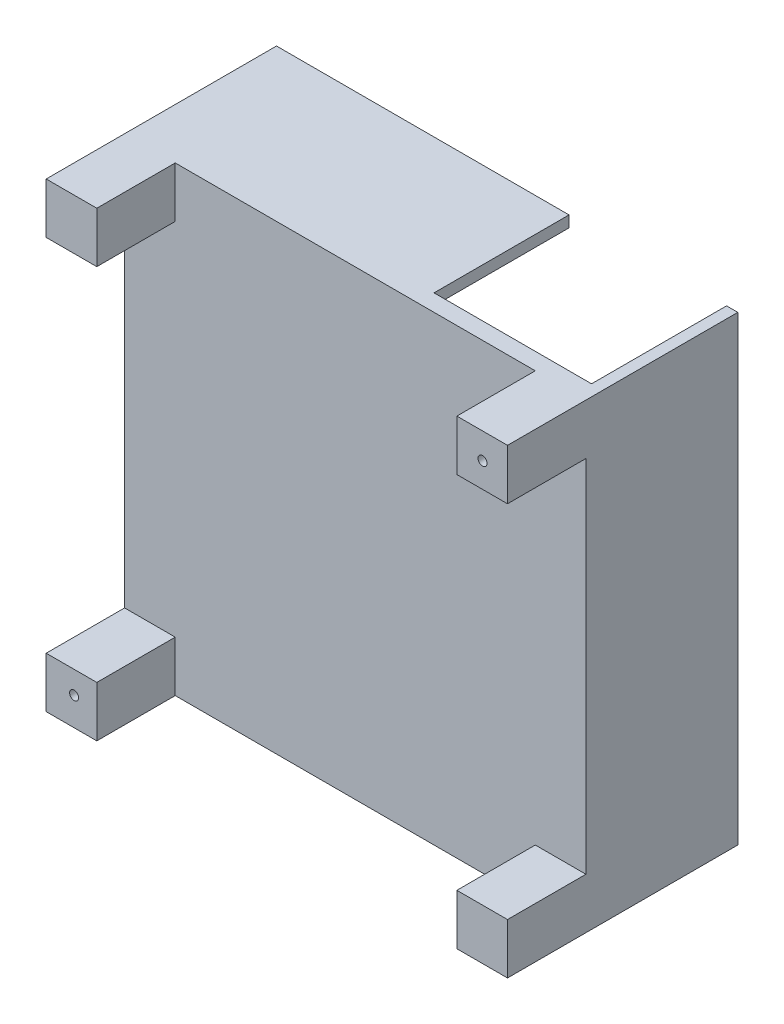
ISO-10303-21;
HEADER;
FILE_DESCRIPTION(('STEP AP214'),'2;1');
FILE_NAME('part.step','',(''),(''),'','','');
FILE_SCHEMA(('AUTOMOTIVE_DESIGN { 1 0 10303 214 1 1 1 1 }'));
ENDSEC;
DATA;
#1=APPLICATION_CONTEXT('core data for automotive mechanical design processes');
#2=APPLICATION_PROTOCOL_DEFINITION('international standard','automotive_design',2000,#1);
#3=PRODUCT_CONTEXT('',#1,'mechanical');
#4=PRODUCT('Part','Part','',(#3));
#5=PRODUCT_RELATED_PRODUCT_CATEGORY('part','',(#4));
#6=PRODUCT_DEFINITION_FORMATION('','',#4);
#7=PRODUCT_DEFINITION_CONTEXT('part definition',#1,'design');
#8=PRODUCT_DEFINITION('design','',#6,#7);
#9=PRODUCT_DEFINITION_SHAPE('','',#8);
#10=(LENGTH_UNIT() NAMED_UNIT(*) SI_UNIT(.MILLI.,.METRE.));
#11=(NAMED_UNIT(*) PLANE_ANGLE_UNIT() SI_UNIT($,.RADIAN.));
#12=(NAMED_UNIT(*) SI_UNIT($,.STERADIAN.) SOLID_ANGLE_UNIT());
#13=UNCERTAINTY_MEASURE_WITH_UNIT(LENGTH_MEASURE(1.E-05),#10,'distance_accuracy_value','');
#14=(GEOMETRIC_REPRESENTATION_CONTEXT(3) GLOBAL_UNCERTAINTY_ASSIGNED_CONTEXT((#13)) GLOBAL_UNIT_ASSIGNED_CONTEXT((#10,
#11,#12)) REPRESENTATION_CONTEXT('',''));
#15=CARTESIAN_POINT('',(0.,0.,0.));
#16=DIRECTION('',(0.,0.,1.));
#17=DIRECTION('',(1.,0.,0.));
#18=AXIS2_PLACEMENT_3D('',#15,#16,#17);
#19=CARTESIAN_POINT('',(0.,0.,0.));
#20=DIRECTION('',(0.,0.,-1.));
#21=DIRECTION('',(-1.,0.,0.));
#22=AXIS2_PLACEMENT_3D('',#19,#20,#21);
#23=PLANE('',#22);
#24=CARTESIAN_POINT('',(2.4810758576871,2.50000000000042,0.));
#25=DIRECTION('',(0.,0.,-1.));
#26=DIRECTION('',(-1.,0.,0.));
#27=AXIS2_PLACEMENT_3D('',#24,#25,#26);
#28=CIRCLE('',#27,0.4);
#29=CARTESIAN_POINT('',(2.0810758576871,2.50000000000042,0.));
#30=VERTEX_POINT('',#29);
#31=EDGE_CURVE('E666',#30,#30,#28,.T.);
#32=ORIENTED_EDGE('',*,*,#31,.F.);
#33=EDGE_LOOP('',(#32));
#34=FACE_BOUND('',#33,.T.);
#35=CARTESIAN_POINT('',(38.7810758576871,38.7000000000004,0.));
#36=DIRECTION('',(0.,0.,-1.));
#37=DIRECTION('',(-1.,0.,0.));
#38=AXIS2_PLACEMENT_3D('',#35,#36,#37);
#39=CIRCLE('',#38,0.399999999999997);
#40=CARTESIAN_POINT('',(38.3810758576871,38.7000000000004,0.));
#41=VERTEX_POINT('',#40);
#42=EDGE_CURVE('E347',#41,#41,#39,.T.);
#43=ORIENTED_EDGE('',*,*,#42,.F.);
#44=EDGE_LOOP('',(#43));
#45=FACE_BOUND('',#44,.T.);
#46=DIRECTION('',(-1.,0.,0.));
#47=VECTOR('',#46,1.);
#48=CARTESIAN_POINT('',(26.,40.,0.));
#49=LINE('',#48,#47);
#50=CARTESIAN_POINT('',(26.,40.,0.));
#51=VERTEX_POINT('',#50);
#52=CARTESIAN_POINT('',(0.,40.,0.));
#53=VERTEX_POINT('',#52);
#54=EDGE_CURVE('E51',#51,#53,#49,.T.);
#55=ORIENTED_EDGE('',*,*,#54,.F.);
#56=DIRECTION('',(0.,-1.,0.));
#57=VECTOR('',#56,1.);
#58=CARTESIAN_POINT('',(26.,41.,0.));
#59=LINE('',#58,#57);
#60=CARTESIAN_POINT('',(26.,41.,0.));
#61=VERTEX_POINT('',#60);
#62=EDGE_CURVE('E200',#61,#51,#59,.T.);
#63=ORIENTED_EDGE('',*,*,#62,.F.);
#64=DIRECTION('',(1.,0.,0.));
#65=VECTOR('',#64,1.);
#66=CARTESIAN_POINT('',(0.,41.,0.));
#67=LINE('',#66,#65);
#68=CARTESIAN_POINT('',(40.,41.,0.));
#69=VERTEX_POINT('',#68);
#70=EDGE_CURVE('E330',#61,#69,#67,.T.);
#71=ORIENTED_EDGE('',*,*,#70,.T.);
#72=DIRECTION('',(0.,1.,0.));
#73=VECTOR('',#72,1.);
#74=CARTESIAN_POINT('',(40.,41.,0.));
#75=LINE('',#74,#73);
#76=CARTESIAN_POINT('',(40.,0.,0.));
#77=VERTEX_POINT('',#76);
#78=EDGE_CURVE('E201',#77,#69,#75,.T.);
#79=ORIENTED_EDGE('',*,*,#78,.F.);
#80=DIRECTION('',(1.,0.,0.));
#81=VECTOR('',#80,1.);
#82=CARTESIAN_POINT('',(0.,0.,0.));
#83=LINE('',#82,#81);
#84=CARTESIAN_POINT('',(0.,0.,0.));
#85=VERTEX_POINT('',#84);
#86=EDGE_CURVE('E321',#85,#77,#83,.T.);
#87=ORIENTED_EDGE('',*,*,#86,.F.);
#88=DIRECTION('',(0.,1.,0.));
#89=VECTOR('',#88,1.);
#90=CARTESIAN_POINT('',(0.,0.,0.));
#91=LINE('',#90,#89);
#92=EDGE_CURVE('E56',#85,#53,#91,.T.);
#93=ORIENTED_EDGE('',*,*,#92,.T.);
#94=EDGE_LOOP('',(#55,#63,#71,#79,#87,#93));
#95=FACE_BOUND('',#94,.T.);
#96=ADVANCED_FACE('F34',(#34,#45,#95),#23,.T.);
#97=CARTESIAN_POINT('',(0.,0.,1.5));
#98=DIRECTION('',(0.,0.,-1.));
#99=DIRECTION('',(-1.,0.,0.));
#100=AXIS2_PLACEMENT_3D('',#97,#98,#99);
#101=PLANE('',#100);
#102=DIRECTION('',(0.,-1.,0.));
#103=VECTOR('',#102,1.);
#104=CARTESIAN_POINT('',(36.5,41.,1.5));
#105=LINE('',#104,#103);
#106=CARTESIAN_POINT('',(36.5,41.,1.5));
#107=VERTEX_POINT('',#106);
#108=CARTESIAN_POINT('',(36.5,36.5,1.5));
#109=VERTEX_POINT('',#108);
#110=EDGE_CURVE('E225',#107,#109,#105,.T.);
#111=ORIENTED_EDGE('',*,*,#110,.F.);
#112=DIRECTION('',(1.,0.,0.));
#113=VECTOR('',#112,1.);
#114=CARTESIAN_POINT('',(0.,41.,1.5));
#115=LINE('',#114,#113);
#116=CARTESIAN_POINT('',(4.5,41.,1.5));
#117=VERTEX_POINT('',#116);
#118=EDGE_CURVE('E320',#117,#107,#115,.T.);
#119=ORIENTED_EDGE('',*,*,#118,.F.);
#120=DIRECTION('',(0.,1.,0.));
#121=VECTOR('',#120,1.);
#122=CARTESIAN_POINT('',(4.5,41.,1.5));
#123=LINE('',#122,#121);
#124=CARTESIAN_POINT('',(4.5,36.5,1.5));
#125=VERTEX_POINT('',#124);
#126=EDGE_CURVE('E251',#125,#117,#123,.T.);
#127=ORIENTED_EDGE('',*,*,#126,.F.);
#128=DIRECTION('',(1.,0.,0.));
#129=VECTOR('',#128,1.);
#130=CARTESIAN_POINT('',(0.,36.5,1.5));
#131=LINE('',#130,#129);
#132=CARTESIAN_POINT('',(0.,36.5,1.5));
#133=VERTEX_POINT('',#132);
#134=EDGE_CURVE('E246',#133,#125,#131,.T.);
#135=ORIENTED_EDGE('',*,*,#134,.F.);
#136=DIRECTION('',(0.,1.,0.));
#137=VECTOR('',#136,1.);
#138=CARTESIAN_POINT('',(0.,0.,1.5));
#139=LINE('',#138,#137);
#140=CARTESIAN_POINT('',(0.,4.5,1.5));
#141=VERTEX_POINT('',#140);
#142=EDGE_CURVE('E317',#141,#133,#139,.T.);
#143=ORIENTED_EDGE('',*,*,#142,.F.);
#144=DIRECTION('',(-1.,0.,0.));
#145=VECTOR('',#144,1.);
#146=CARTESIAN_POINT('',(0.,4.5,1.5));
#147=LINE('',#146,#145);
#148=CARTESIAN_POINT('',(4.5,4.5,1.5));
#149=VERTEX_POINT('',#148);
#150=EDGE_CURVE('E298',#149,#141,#147,.T.);
#151=ORIENTED_EDGE('',*,*,#150,.F.);
#152=DIRECTION('',(0.,1.,0.));
#153=VECTOR('',#152,1.);
#154=CARTESIAN_POINT('',(4.5,0.,1.5));
#155=LINE('',#154,#153);
#156=CARTESIAN_POINT('',(4.5,0.,1.5));
#157=VERTEX_POINT('',#156);
#158=EDGE_CURVE('E293',#157,#149,#155,.T.);
#159=ORIENTED_EDGE('',*,*,#158,.F.);
#160=DIRECTION('',(1.,0.,0.));
#161=VECTOR('',#160,1.);
#162=CARTESIAN_POINT('',(0.,0.,1.5));
#163=LINE('',#162,#161);
#164=CARTESIAN_POINT('',(36.5,0.,1.5));
#165=VERTEX_POINT('',#164);
#166=EDGE_CURVE('E327',#157,#165,#163,.T.);
#167=ORIENTED_EDGE('',*,*,#166,.T.);
#168=DIRECTION('',(0.,-1.,0.));
#169=VECTOR('',#168,1.);
#170=CARTESIAN_POINT('',(36.5,0.,1.5));
#171=LINE('',#170,#169);
#172=CARTESIAN_POINT('',(36.5,4.5,1.5));
#173=VERTEX_POINT('',#172);
#174=EDGE_CURVE('E273',#173,#165,#171,.T.);
#175=ORIENTED_EDGE('',*,*,#174,.F.);
#176=DIRECTION('',(-1.,0.,0.));
#177=VECTOR('',#176,1.);
#178=CARTESIAN_POINT('',(41.,4.5,1.5));
#179=LINE('',#178,#177);
#180=CARTESIAN_POINT('',(41.,4.5,1.5));
#181=VERTEX_POINT('',#180);
#182=EDGE_CURVE('E268',#181,#173,#179,.T.);
#183=ORIENTED_EDGE('',*,*,#182,.F.);
#184=DIRECTION('',(0.,1.,0.));
#185=VECTOR('',#184,1.);
#186=CARTESIAN_POINT('',(41.,0.,1.5));
#187=LINE('',#186,#185);
#188=CARTESIAN_POINT('',(41.,36.5,1.5));
#189=VERTEX_POINT('',#188);
#190=EDGE_CURVE('E324',#181,#189,#187,.T.);
#191=ORIENTED_EDGE('',*,*,#190,.T.);
#192=DIRECTION('',(1.,0.,0.));
#193=VECTOR('',#192,1.);
#194=CARTESIAN_POINT('',(41.,36.5,1.5));
#195=LINE('',#194,#193);
#196=EDGE_CURVE('E230',#109,#189,#195,.T.);
#197=ORIENTED_EDGE('',*,*,#196,.F.);
#198=EDGE_LOOP('',(#111,#119,#127,#135,#143,#151,#159,#167,#175,#183,#191,#197));
#199=FACE_BOUND('',#198,.T.);
#200=ADVANCED_FACE('F365',(#199),#101,.F.);
#201=CARTESIAN_POINT('',(0.,0.,1.5));
#202=DIRECTION('',(-1.,0.,0.));
#203=DIRECTION('',(0.,0.,1.));
#204=AXIS2_PLACEMENT_3D('',#201,#202,#203);
#205=PLANE('',#204);
#206=ORIENTED_EDGE('',*,*,#92,.F.);
#207=DIRECTION('',(0.,0.,-1.));
#208=VECTOR('',#207,1.);
#209=CARTESIAN_POINT('',(0.,0.,1.5));
#210=LINE('',#209,#208);
#211=CARTESIAN_POINT('',(0.,0.,8.47));
#212=VERTEX_POINT('',#211);
#213=EDGE_CURVE('E11',#212,#85,#210,.T.);
#214=ORIENTED_EDGE('',*,*,#213,.F.);
#215=DIRECTION('',(0.,-1.,0.));
#216=VECTOR('',#215,1.);
#217=CARTESIAN_POINT('',(0.,0.,8.47));
#218=LINE('',#217,#216);
#219=CARTESIAN_POINT('',(0.,4.5,8.47));
#220=VERTEX_POINT('',#219);
#221=EDGE_CURVE('E294',#220,#212,#218,.T.);
#222=ORIENTED_EDGE('',*,*,#221,.F.);
#223=DIRECTION('',(0.,0.,-1.));
#224=VECTOR('',#223,1.);
#225=CARTESIAN_POINT('',(0.,4.5,8.47));
#226=LINE('',#225,#224);
#227=EDGE_CURVE('E304',#220,#141,#226,.T.);
#228=ORIENTED_EDGE('',*,*,#227,.T.);
#229=ORIENTED_EDGE('',*,*,#142,.T.);
#230=DIRECTION('',(0.,0.,-1.));
#231=VECTOR('',#230,1.);
#232=CARTESIAN_POINT('',(0.,36.5,8.47));
#233=LINE('',#232,#231);
#234=CARTESIAN_POINT('',(0.,36.5,8.47));
#235=VERTEX_POINT('',#234);
#236=EDGE_CURVE('E266',#235,#133,#233,.T.);
#237=ORIENTED_EDGE('',*,*,#236,.F.);
#238=DIRECTION('',(0.,-1.,0.));
#239=VECTOR('',#238,1.);
#240=CARTESIAN_POINT('',(0.,41.,8.47));
#241=LINE('',#240,#239);
#242=CARTESIAN_POINT('',(0.,41.,8.47));
#243=VERTEX_POINT('',#242);
#244=EDGE_CURVE('E247',#243,#235,#241,.T.);
#245=ORIENTED_EDGE('',*,*,#244,.F.);
#246=DIRECTION('',(0.,0.,-1.));
#247=VECTOR('',#246,1.);
#248=CARTESIAN_POINT('',(0.,41.,1.5));
#249=LINE('',#248,#247);
#250=CARTESIAN_POINT('',(0.,41.,-12.));
#251=VERTEX_POINT('',#250);
#252=EDGE_CURVE('E38',#243,#251,#249,.T.);
#253=ORIENTED_EDGE('',*,*,#252,.T.);
#254=DIRECTION('',(0.,1.,0.));
#255=VECTOR('',#254,1.);
#256=CARTESIAN_POINT('',(0.,41.,-12.));
#257=LINE('',#256,#255);
#258=CARTESIAN_POINT('',(0.,40.,-12.));
#259=VERTEX_POINT('',#258);
#260=EDGE_CURVE('E188',#259,#251,#257,.T.);
#261=ORIENTED_EDGE('',*,*,#260,.F.);
#262=DIRECTION('',(0.,0.,1.));
#263=VECTOR('',#262,1.);
#264=CARTESIAN_POINT('',(0.,40.,-12.));
#265=LINE('',#264,#263);
#266=EDGE_CURVE('E184',#259,#53,#265,.T.);
#267=ORIENTED_EDGE('',*,*,#266,.T.);
#268=EDGE_LOOP('',(#206,#214,#222,#228,#229,#237,#245,#253,#261,#267));
#269=FACE_BOUND('',#268,.T.);
#270=ADVANCED_FACE('F36',(#269),#205,.T.);
#271=CARTESIAN_POINT('',(0.,0.,1.5));
#272=DIRECTION('',(0.,1.,0.));
#273=DIRECTION('',(0.,0.,1.));
#274=AXIS2_PLACEMENT_3D('',#271,#272,#273);
#275=PLANE('',#274);
#276=ORIENTED_EDGE('',*,*,#86,.T.);
#277=DIRECTION('',(0.,0.,1.));
#278=VECTOR('',#277,1.);
#279=CARTESIAN_POINT('',(40.,0.,-12.));
#280=LINE('',#279,#278);
#281=CARTESIAN_POINT('',(40.,0.,-12.));
#282=VERTEX_POINT('',#281);
#283=EDGE_CURVE('E222',#282,#77,#280,.T.);
#284=ORIENTED_EDGE('',*,*,#283,.F.);
#285=DIRECTION('',(-1.,0.,0.));
#286=VECTOR('',#285,1.);
#287=CARTESIAN_POINT('',(41.,0.,-12.));
#288=LINE('',#287,#286);
#289=CARTESIAN_POINT('',(41.,0.,-12.));
#290=VERTEX_POINT('',#289);
#291=EDGE_CURVE('E212',#290,#282,#288,.T.);
#292=ORIENTED_EDGE('',*,*,#291,.F.);
#293=DIRECTION('',(0.,0.,-1.));
#294=VECTOR('',#293,1.);
#295=CARTESIAN_POINT('',(41.,0.,1.5));
#296=LINE('',#295,#294);
#297=CARTESIAN_POINT('',(41.,0.,8.47));
#298=VERTEX_POINT('',#297);
#299=EDGE_CURVE('E43',#298,#290,#296,.T.);
#300=ORIENTED_EDGE('',*,*,#299,.F.);
#301=DIRECTION('',(1.,0.,0.));
#302=VECTOR('',#301,1.);
#303=CARTESIAN_POINT('',(41.,0.,8.47));
#304=LINE('',#303,#302);
#305=CARTESIAN_POINT('',(36.5,0.,8.47));
#306=VERTEX_POINT('',#305);
#307=EDGE_CURVE('E277',#306,#298,#304,.T.);
#308=ORIENTED_EDGE('',*,*,#307,.F.);
#309=DIRECTION('',(0.,0.,-1.));
#310=VECTOR('',#309,1.);
#311=CARTESIAN_POINT('',(36.5,0.,8.47));
#312=LINE('',#311,#310);
#313=EDGE_CURVE('E280',#306,#165,#312,.T.);
#314=ORIENTED_EDGE('',*,*,#313,.T.);
#315=ORIENTED_EDGE('',*,*,#166,.F.);
#316=DIRECTION('',(0.,0.,-1.));
#317=VECTOR('',#316,1.);
#318=CARTESIAN_POINT('',(4.5,0.,8.47));
#319=LINE('',#318,#317);
#320=CARTESIAN_POINT('',(4.5,0.,8.47));
#321=VERTEX_POINT('',#320);
#322=EDGE_CURVE('E314',#321,#157,#319,.T.);
#323=ORIENTED_EDGE('',*,*,#322,.F.);
#324=DIRECTION('',(1.,0.,0.));
#325=VECTOR('',#324,1.);
#326=CARTESIAN_POINT('',(0.,0.,8.47));
#327=LINE('',#326,#325);
#328=EDGE_CURVE('E297',#212,#321,#327,.T.);
#329=ORIENTED_EDGE('',*,*,#328,.F.);
#330=ORIENTED_EDGE('',*,*,#213,.T.);
#331=EDGE_LOOP('',(#276,#284,#292,#300,#308,#314,#315,#323,#329,#330));
#332=FACE_BOUND('',#331,.T.);
#333=ADVANCED_FACE('F352',(#332),#275,.F.);
#334=CARTESIAN_POINT('',(41.,0.,1.5));
#335=DIRECTION('',(-1.,0.,0.));
#336=DIRECTION('',(0.,0.,1.));
#337=AXIS2_PLACEMENT_3D('',#334,#335,#336);
#338=PLANE('',#337);
#339=ORIENTED_EDGE('',*,*,#299,.T.);
#340=DIRECTION('',(0.,-1.,0.));
#341=VECTOR('',#340,1.);
#342=CARTESIAN_POINT('',(41.,41.,-12.));
#343=LINE('',#342,#341);
#344=CARTESIAN_POINT('',(41.,41.,-12.));
#345=VERTEX_POINT('',#344);
#346=EDGE_CURVE('E204',#345,#290,#343,.T.);
#347=ORIENTED_EDGE('',*,*,#346,.F.);
#348=DIRECTION('',(0.,0.,-1.));
#349=VECTOR('',#348,1.);
#350=CARTESIAN_POINT('',(41.,41.,1.5));
#351=LINE('',#350,#349);
#352=CARTESIAN_POINT('',(41.,41.,8.47));
#353=VERTEX_POINT('',#352);
#354=EDGE_CURVE('E334',#353,#345,#351,.T.);
#355=ORIENTED_EDGE('',*,*,#354,.F.);
#356=DIRECTION('',(0.,1.,0.));
#357=VECTOR('',#356,1.);
#358=CARTESIAN_POINT('',(41.,41.,8.47));
#359=LINE('',#358,#357);
#360=CARTESIAN_POINT('',(41.,36.5,8.47));
#361=VERTEX_POINT('',#360);
#362=EDGE_CURVE('E226',#361,#353,#359,.T.);
#363=ORIENTED_EDGE('',*,*,#362,.F.);
#364=DIRECTION('',(0.,0.,-1.));
#365=VECTOR('',#364,1.);
#366=CARTESIAN_POINT('',(41.,36.5,8.47));
#367=LINE('',#366,#365);
#368=EDGE_CURVE('E236',#361,#189,#367,.T.);
#369=ORIENTED_EDGE('',*,*,#368,.T.);
#370=ORIENTED_EDGE('',*,*,#190,.F.);
#371=DIRECTION('',(0.,0.,-1.));
#372=VECTOR('',#371,1.);
#373=CARTESIAN_POINT('',(41.,4.5,8.47));
#374=LINE('',#373,#372);
#375=CARTESIAN_POINT('',(41.,4.5,8.47));
#376=VERTEX_POINT('',#375);
#377=EDGE_CURVE('E290',#376,#181,#374,.T.);
#378=ORIENTED_EDGE('',*,*,#377,.F.);
#379=DIRECTION('',(0.,1.,0.));
#380=VECTOR('',#379,1.);
#381=CARTESIAN_POINT('',(41.,0.,8.47));
#382=LINE('',#381,#380);
#383=EDGE_CURVE('E269',#298,#376,#382,.T.);
#384=ORIENTED_EDGE('',*,*,#383,.F.);
#385=EDGE_LOOP('',(#339,#347,#355,#363,#369,#370,#378,#384));
#386=FACE_BOUND('',#385,.T.);
#387=ADVANCED_FACE('F391',(#386),#338,.F.);
#388=CARTESIAN_POINT('',(0.,41.,1.5));
#389=DIRECTION('',(0.,1.,0.));
#390=DIRECTION('',(0.,0.,1.));
#391=AXIS2_PLACEMENT_3D('',#388,#389,#390);
#392=PLANE('',#391);
#393=ORIENTED_EDGE('',*,*,#70,.F.);
#394=DIRECTION('',(0.,0.,1.));
#395=VECTOR('',#394,1.);
#396=CARTESIAN_POINT('',(26.,41.,-12.));
#397=LINE('',#396,#395);
#398=CARTESIAN_POINT('',(26.,41.,-12.));
#399=VERTEX_POINT('',#398);
#400=EDGE_CURVE('E206',#399,#61,#397,.T.);
#401=ORIENTED_EDGE('',*,*,#400,.F.);
#402=DIRECTION('',(1.,0.,0.));
#403=VECTOR('',#402,1.);
#404=CARTESIAN_POINT('',(26.,41.,-12.));
#405=LINE('',#404,#403);
#406=EDGE_CURVE('E194',#251,#399,#405,.T.);
#407=ORIENTED_EDGE('',*,*,#406,.F.);
#408=ORIENTED_EDGE('',*,*,#252,.F.);
#409=DIRECTION('',(-1.,0.,0.));
#410=VECTOR('',#409,1.);
#411=CARTESIAN_POINT('',(0.,41.,8.47));
#412=LINE('',#411,#410);
#413=CARTESIAN_POINT('',(4.5,41.,8.47));
#414=VERTEX_POINT('',#413);
#415=EDGE_CURVE('E255',#414,#243,#412,.T.);
#416=ORIENTED_EDGE('',*,*,#415,.F.);
#417=DIRECTION('',(0.,0.,-1.));
#418=VECTOR('',#417,1.);
#419=CARTESIAN_POINT('',(4.5,41.,8.47));
#420=LINE('',#419,#418);
#421=EDGE_CURVE('E258',#414,#117,#420,.T.);
#422=ORIENTED_EDGE('',*,*,#421,.T.);
#423=ORIENTED_EDGE('',*,*,#118,.T.);
#424=DIRECTION('',(0.,0.,-1.));
#425=VECTOR('',#424,1.);
#426=CARTESIAN_POINT('',(36.5,41.,8.47));
#427=LINE('',#426,#425);
#428=CARTESIAN_POINT('',(36.5,41.,8.47));
#429=VERTEX_POINT('',#428);
#430=EDGE_CURVE('E244',#429,#107,#427,.T.);
#431=ORIENTED_EDGE('',*,*,#430,.F.);
#432=DIRECTION('',(-1.,0.,0.));
#433=VECTOR('',#432,1.);
#434=CARTESIAN_POINT('',(41.,41.,8.47));
#435=LINE('',#434,#433);
#436=EDGE_CURVE('E229',#353,#429,#435,.T.);
#437=ORIENTED_EDGE('',*,*,#436,.F.);
#438=ORIENTED_EDGE('',*,*,#354,.T.);
#439=DIRECTION('',(1.,0.,0.));
#440=VECTOR('',#439,1.);
#441=CARTESIAN_POINT('',(41.,41.,-12.));
#442=LINE('',#441,#440);
#443=CARTESIAN_POINT('',(40.,41.,-12.));
#444=VERTEX_POINT('',#443);
#445=EDGE_CURVE('E216',#444,#345,#442,.T.);
#446=ORIENTED_EDGE('',*,*,#445,.F.);
#447=DIRECTION('',(0.,0.,1.));
#448=VECTOR('',#447,1.);
#449=CARTESIAN_POINT('',(40.,41.,-12.));
#450=LINE('',#449,#448);
#451=EDGE_CURVE('E218',#444,#69,#450,.T.);
#452=ORIENTED_EDGE('',*,*,#451,.T.);
#453=EDGE_LOOP('',(#393,#401,#407,#408,#416,#422,#423,#431,#437,#438,#446,#452));
#454=FACE_BOUND('',#453,.T.);
#455=ADVANCED_FACE('F343',(#454),#392,.T.);
#456=CARTESIAN_POINT('',(4.5,0.,8.47));
#457=DIRECTION('',(-1.,0.,0.));
#458=DIRECTION('',(0.,-1.,0.));
#459=AXIS2_PLACEMENT_3D('',#456,#457,#458);
#460=PLANE('',#459);
#461=ORIENTED_EDGE('',*,*,#158,.T.);
#462=DIRECTION('',(0.,0.,-1.));
#463=VECTOR('',#462,1.);
#464=CARTESIAN_POINT('',(4.5,4.5,8.47));
#465=LINE('',#464,#463);
#466=CARTESIAN_POINT('',(4.5,4.5,8.47));
#467=VERTEX_POINT('',#466);
#468=EDGE_CURVE('E311',#467,#149,#465,.T.);
#469=ORIENTED_EDGE('',*,*,#468,.F.);
#470=DIRECTION('',(0.,1.,0.));
#471=VECTOR('',#470,1.);
#472=CARTESIAN_POINT('',(4.5,0.,8.47));
#473=LINE('',#472,#471);
#474=EDGE_CURVE('E300',#321,#467,#473,.T.);
#475=ORIENTED_EDGE('',*,*,#474,.F.);
#476=ORIENTED_EDGE('',*,*,#322,.T.);
#477=EDGE_LOOP('',(#461,#469,#475,#476));
#478=FACE_BOUND('',#477,.T.);
#479=ADVANCED_FACE('F415',(#478),#460,.F.);
#480=CARTESIAN_POINT('',(0.,4.5,8.47));
#481=DIRECTION('',(0.,-1.,0.));
#482=DIRECTION('',(0.,0.,-1.));
#483=AXIS2_PLACEMENT_3D('',#480,#481,#482);
#484=PLANE('',#483);
#485=ORIENTED_EDGE('',*,*,#150,.T.);
#486=ORIENTED_EDGE('',*,*,#227,.F.);
#487=DIRECTION('',(-1.,0.,0.));
#488=VECTOR('',#487,1.);
#489=CARTESIAN_POINT('',(0.,4.5,8.47));
#490=LINE('',#489,#488);
#491=EDGE_CURVE('E302',#467,#220,#490,.T.);
#492=ORIENTED_EDGE('',*,*,#491,.F.);
#493=ORIENTED_EDGE('',*,*,#468,.T.);
#494=EDGE_LOOP('',(#485,#486,#492,#493));
#495=FACE_BOUND('',#494,.T.);
#496=ADVANCED_FACE('F361',(#495),#484,.F.);
#497=CARTESIAN_POINT('',(0.,0.,8.47));
#498=DIRECTION('',(0.,0.,-1.));
#499=DIRECTION('',(-1.,0.,0.));
#500=AXIS2_PLACEMENT_3D('',#497,#498,#499);
#501=PLANE('',#500);
#502=CARTESIAN_POINT('',(2.4810758576871,2.50000000000042,8.47));
#503=DIRECTION('',(0.,0.,1.));
#504=DIRECTION('',(1.,0.,0.));
#505=AXIS2_PLACEMENT_3D('',#502,#503,#504);
#506=CIRCLE('',#505,0.4);
#507=CARTESIAN_POINT('',(2.8810758576871,2.50000000000042,8.47));
#508=VERTEX_POINT('',#507);
#509=EDGE_CURVE('E664',#508,#508,#506,.T.);
#510=ORIENTED_EDGE('',*,*,#509,.F.);
#511=EDGE_LOOP('',(#510));
#512=FACE_BOUND('',#511,.T.);
#513=ORIENTED_EDGE('',*,*,#221,.T.);
#514=ORIENTED_EDGE('',*,*,#328,.T.);
#515=ORIENTED_EDGE('',*,*,#474,.T.);
#516=ORIENTED_EDGE('',*,*,#491,.T.);
#517=EDGE_LOOP('',(#513,#514,#515,#516));
#518=FACE_BOUND('',#517,.T.);
#519=ADVANCED_FACE('F356',(#512,#518),#501,.F.);
#520=CARTESIAN_POINT('',(41.,4.5,8.47));
#521=DIRECTION('',(0.,-1.,0.));
#522=DIRECTION('',(1.,0.,0.));
#523=AXIS2_PLACEMENT_3D('',#520,#521,#522);
#524=PLANE('',#523);
#525=ORIENTED_EDGE('',*,*,#182,.T.);
#526=DIRECTION('',(0.,0.,-1.));
#527=VECTOR('',#526,1.);
#528=CARTESIAN_POINT('',(36.5,4.5,8.47));
#529=LINE('',#528,#527);
#530=CARTESIAN_POINT('',(36.5,4.5,8.47));
#531=VERTEX_POINT('',#530);
#532=EDGE_CURVE('E287',#531,#173,#529,.T.);
#533=ORIENTED_EDGE('',*,*,#532,.F.);
#534=DIRECTION('',(-1.,0.,0.));
#535=VECTOR('',#534,1.);
#536=CARTESIAN_POINT('',(41.,4.5,8.47));
#537=LINE('',#536,#535);
#538=EDGE_CURVE('E272',#376,#531,#537,.T.);
#539=ORIENTED_EDGE('',*,*,#538,.F.);
#540=ORIENTED_EDGE('',*,*,#377,.T.);
#541=EDGE_LOOP('',(#525,#533,#539,#540));
#542=FACE_BOUND('',#541,.T.);
#543=ADVANCED_FACE('F410',(#542),#524,.F.);
#544=CARTESIAN_POINT('',(36.5,0.,8.47));
#545=DIRECTION('',(1.,0.,0.));
#546=DIRECTION('',(0.,0.,-1.));
#547=AXIS2_PLACEMENT_3D('',#544,#545,#546);
#548=PLANE('',#547);
#549=ORIENTED_EDGE('',*,*,#174,.T.);
#550=ORIENTED_EDGE('',*,*,#313,.F.);
#551=DIRECTION('',(0.,-1.,0.));
#552=VECTOR('',#551,1.);
#553=CARTESIAN_POINT('',(36.5,0.,8.47));
#554=LINE('',#553,#552);
#555=EDGE_CURVE('E275',#531,#306,#554,.T.);
#556=ORIENTED_EDGE('',*,*,#555,.F.);
#557=ORIENTED_EDGE('',*,*,#532,.T.);
#558=EDGE_LOOP('',(#549,#550,#556,#557));
#559=FACE_BOUND('',#558,.T.);
#560=ADVANCED_FACE('F413',(#559),#548,.F.);
#561=CARTESIAN_POINT('',(0.,0.,8.47));
#562=DIRECTION('',(0.,0.,1.));
#563=DIRECTION('',(1.,0.,0.));
#564=AXIS2_PLACEMENT_3D('',#561,#562,#563);
#565=PLANE('',#564);
#566=ORIENTED_EDGE('',*,*,#383,.T.);
#567=ORIENTED_EDGE('',*,*,#538,.T.);
#568=ORIENTED_EDGE('',*,*,#555,.T.);
#569=ORIENTED_EDGE('',*,*,#307,.T.);
#570=EDGE_LOOP('',(#566,#567,#568,#569));
#571=FACE_BOUND('',#570,.T.);
#572=ADVANCED_FACE('F404',(#571),#565,.T.);
#573=CARTESIAN_POINT('',(0.,36.5,8.47));
#574=DIRECTION('',(0.,1.,0.));
#575=DIRECTION('',(0.,0.,1.));
#576=AXIS2_PLACEMENT_3D('',#573,#574,#575);
#577=PLANE('',#576);
#578=ORIENTED_EDGE('',*,*,#134,.T.);
#579=DIRECTION('',(0.,0.,-1.));
#580=VECTOR('',#579,1.);
#581=CARTESIAN_POINT('',(4.5,36.5,8.47));
#582=LINE('',#581,#580);
#583=CARTESIAN_POINT('',(4.5,36.5,8.47));
#584=VERTEX_POINT('',#583);
#585=EDGE_CURVE('E263',#584,#125,#582,.T.);
#586=ORIENTED_EDGE('',*,*,#585,.F.);
#587=DIRECTION('',(1.,0.,0.));
#588=VECTOR('',#587,1.);
#589=CARTESIAN_POINT('',(0.,36.5,8.47));
#590=LINE('',#589,#588);
#591=EDGE_CURVE('E250',#235,#584,#590,.T.);
#592=ORIENTED_EDGE('',*,*,#591,.F.);
#593=ORIENTED_EDGE('',*,*,#236,.T.);
#594=EDGE_LOOP('',(#578,#586,#592,#593));
#595=FACE_BOUND('',#594,.T.);
#596=ADVANCED_FACE('F370',(#595),#577,.F.);
#597=CARTESIAN_POINT('',(4.5,41.,8.47));
#598=DIRECTION('',(-1.,0.,0.));
#599=DIRECTION('',(0.,-1.,0.));
#600=AXIS2_PLACEMENT_3D('',#597,#598,#599);
#601=PLANE('',#600);
#602=ORIENTED_EDGE('',*,*,#126,.T.);
#603=ORIENTED_EDGE('',*,*,#421,.F.);
#604=DIRECTION('',(0.,1.,0.));
#605=VECTOR('',#604,1.);
#606=CARTESIAN_POINT('',(4.5,41.,8.47));
#607=LINE('',#606,#605);
#608=EDGE_CURVE('E253',#584,#414,#607,.T.);
#609=ORIENTED_EDGE('',*,*,#608,.F.);
#610=ORIENTED_EDGE('',*,*,#585,.T.);
#611=EDGE_LOOP('',(#602,#603,#609,#610));
#612=FACE_BOUND('',#611,.T.);
#613=ADVANCED_FACE('F373',(#612),#601,.F.);
#614=CARTESIAN_POINT('',(0.,0.,8.47));
#615=DIRECTION('',(0.,0.,1.));
#616=DIRECTION('',(1.,0.,0.));
#617=AXIS2_PLACEMENT_3D('',#614,#615,#616);
#618=PLANE('',#617);
#619=ORIENTED_EDGE('',*,*,#244,.T.);
#620=ORIENTED_EDGE('',*,*,#591,.T.);
#621=ORIENTED_EDGE('',*,*,#608,.T.);
#622=ORIENTED_EDGE('',*,*,#415,.T.);
#623=EDGE_LOOP('',(#619,#620,#621,#622));
#624=FACE_BOUND('',#623,.T.);
#625=ADVANCED_FACE('F376',(#624),#618,.T.);
#626=CARTESIAN_POINT('',(36.5,41.,8.47));
#627=DIRECTION('',(1.,0.,0.));
#628=DIRECTION('',(0.,0.,-1.));
#629=AXIS2_PLACEMENT_3D('',#626,#627,#628);
#630=PLANE('',#629);
#631=ORIENTED_EDGE('',*,*,#110,.T.);
#632=DIRECTION('',(0.,0.,-1.));
#633=VECTOR('',#632,1.);
#634=CARTESIAN_POINT('',(36.5,36.5,8.47));
#635=LINE('',#634,#633);
#636=CARTESIAN_POINT('',(36.5,36.5,8.47));
#637=VERTEX_POINT('',#636);
#638=EDGE_CURVE('E241',#637,#109,#635,.T.);
#639=ORIENTED_EDGE('',*,*,#638,.F.);
#640=DIRECTION('',(0.,-1.,0.));
#641=VECTOR('',#640,1.);
#642=CARTESIAN_POINT('',(36.5,41.,8.47));
#643=LINE('',#642,#641);
#644=EDGE_CURVE('E232',#429,#637,#643,.T.);
#645=ORIENTED_EDGE('',*,*,#644,.F.);
#646=ORIENTED_EDGE('',*,*,#430,.T.);
#647=EDGE_LOOP('',(#631,#639,#645,#646));
#648=FACE_BOUND('',#647,.T.);
#649=ADVANCED_FACE('F382',(#648),#630,.F.);
#650=CARTESIAN_POINT('',(41.,36.5,8.47));
#651=DIRECTION('',(0.,1.,0.));
#652=DIRECTION('',(0.,0.,1.));
#653=AXIS2_PLACEMENT_3D('',#650,#651,#652);
#654=PLANE('',#653);
#655=ORIENTED_EDGE('',*,*,#196,.T.);
#656=ORIENTED_EDGE('',*,*,#368,.F.);
#657=DIRECTION('',(1.,0.,0.));
#658=VECTOR('',#657,1.);
#659=CARTESIAN_POINT('',(41.,36.5,8.47));
#660=LINE('',#659,#658);
#661=EDGE_CURVE('E234',#637,#361,#660,.T.);
#662=ORIENTED_EDGE('',*,*,#661,.F.);
#663=ORIENTED_EDGE('',*,*,#638,.T.);
#664=EDGE_LOOP('',(#655,#656,#662,#663));
#665=FACE_BOUND('',#664,.T.);
#666=ADVANCED_FACE('F385',(#665),#654,.F.);
#667=CARTESIAN_POINT('',(0.,0.,8.47));
#668=DIRECTION('',(0.,0.,-1.));
#669=DIRECTION('',(-1.,0.,0.));
#670=AXIS2_PLACEMENT_3D('',#667,#668,#669);
#671=PLANE('',#670);
#672=CARTESIAN_POINT('',(38.7810758576871,38.7000000000004,8.47));
#673=DIRECTION('',(0.,0.,1.));
#674=DIRECTION('',(1.,0.,0.));
#675=AXIS2_PLACEMENT_3D('',#672,#673,#674);
#676=CIRCLE('',#675,0.399999999999997);
#677=CARTESIAN_POINT('',(39.1810758576871,38.7000000000004,8.47));
#678=VERTEX_POINT('',#677);
#679=EDGE_CURVE('E669',#678,#678,#676,.T.);
#680=ORIENTED_EDGE('',*,*,#679,.F.);
#681=EDGE_LOOP('',(#680));
#682=FACE_BOUND('',#681,.T.);
#683=ORIENTED_EDGE('',*,*,#362,.T.);
#684=ORIENTED_EDGE('',*,*,#436,.T.);
#685=ORIENTED_EDGE('',*,*,#644,.T.);
#686=ORIENTED_EDGE('',*,*,#661,.T.);
#687=EDGE_LOOP('',(#683,#684,#685,#686));
#688=FACE_BOUND('',#687,.T.);
#689=ADVANCED_FACE('F389',(#682,#688),#671,.F.);
#690=CARTESIAN_POINT('',(40.,41.,-12.));
#691=DIRECTION('',(1.,0.,0.));
#692=DIRECTION('',(0.,1.,0.));
#693=AXIS2_PLACEMENT_3D('',#690,#691,#692);
#694=PLANE('',#693);
#695=ORIENTED_EDGE('',*,*,#78,.T.);
#696=ORIENTED_EDGE('',*,*,#451,.F.);
#697=DIRECTION('',(0.,1.,0.));
#698=VECTOR('',#697,1.);
#699=CARTESIAN_POINT('',(40.,41.,-12.));
#700=LINE('',#699,#698);
#701=EDGE_CURVE('E214',#282,#444,#700,.T.);
#702=ORIENTED_EDGE('',*,*,#701,.F.);
#703=ORIENTED_EDGE('',*,*,#283,.T.);
#704=EDGE_LOOP('',(#695,#696,#702,#703));
#705=FACE_BOUND('',#704,.T.);
#706=ADVANCED_FACE('F401',(#705),#694,.F.);
#707=CARTESIAN_POINT('',(0.,0.,-12.));
#708=DIRECTION('',(0.,0.,-1.));
#709=DIRECTION('',(-1.,0.,0.));
#710=AXIS2_PLACEMENT_3D('',#707,#708,#709);
#711=PLANE('',#710);
#712=ORIENTED_EDGE('',*,*,#346,.T.);
#713=ORIENTED_EDGE('',*,*,#291,.T.);
#714=ORIENTED_EDGE('',*,*,#701,.T.);
#715=ORIENTED_EDGE('',*,*,#445,.T.);
#716=EDGE_LOOP('',(#712,#713,#714,#715));
#717=FACE_BOUND('',#716,.T.);
#718=ADVANCED_FACE('F396',(#717),#711,.T.);
#719=CARTESIAN_POINT('',(26.,41.,-12.));
#720=DIRECTION('',(-1.,0.,0.));
#721=DIRECTION('',(0.,0.,1.));
#722=AXIS2_PLACEMENT_3D('',#719,#720,#721);
#723=PLANE('',#722);
#724=ORIENTED_EDGE('',*,*,#62,.T.);
#725=DIRECTION('',(0.,0.,1.));
#726=VECTOR('',#725,1.);
#727=CARTESIAN_POINT('',(26.,40.,-12.));
#728=LINE('',#727,#726);
#729=CARTESIAN_POINT('',(26.,40.,-12.));
#730=VERTEX_POINT('',#729);
#731=EDGE_CURVE('E181',#730,#51,#728,.T.);
#732=ORIENTED_EDGE('',*,*,#731,.F.);
#733=DIRECTION('',(0.,-1.,0.));
#734=VECTOR('',#733,1.);
#735=CARTESIAN_POINT('',(26.,41.,-12.));
#736=LINE('',#735,#734);
#737=EDGE_CURVE('E189',#399,#730,#736,.T.);
#738=ORIENTED_EDGE('',*,*,#737,.F.);
#739=ORIENTED_EDGE('',*,*,#400,.T.);
#740=EDGE_LOOP('',(#724,#732,#738,#739));
#741=FACE_BOUND('',#740,.T.);
#742=ADVANCED_FACE('F199',(#741),#723,.F.);
#743=CARTESIAN_POINT('',(26.,40.,-12.));
#744=DIRECTION('',(0.,1.,0.));
#745=DIRECTION('',(0.,0.,1.));
#746=AXIS2_PLACEMENT_3D('',#743,#744,#745);
#747=PLANE('',#746);
#748=ORIENTED_EDGE('',*,*,#54,.T.);
#749=ORIENTED_EDGE('',*,*,#266,.F.);
#750=DIRECTION('',(-1.,0.,0.));
#751=VECTOR('',#750,1.);
#752=CARTESIAN_POINT('',(26.,40.,-12.));
#753=LINE('',#752,#751);
#754=EDGE_CURVE('E177',#730,#259,#753,.T.);
#755=ORIENTED_EDGE('',*,*,#754,.F.);
#756=ORIENTED_EDGE('',*,*,#731,.T.);
#757=EDGE_LOOP('',(#748,#749,#755,#756));
#758=FACE_BOUND('',#757,.T.);
#759=ADVANCED_FACE('F179',(#758),#747,.F.);
#760=CARTESIAN_POINT('',(0.,0.,-12.));
#761=DIRECTION('',(0.,0.,-1.));
#762=DIRECTION('',(-1.,0.,0.));
#763=AXIS2_PLACEMENT_3D('',#760,#761,#762);
#764=PLANE('',#763);
#765=ORIENTED_EDGE('',*,*,#737,.T.);
#766=ORIENTED_EDGE('',*,*,#754,.T.);
#767=ORIENTED_EDGE('',*,*,#260,.T.);
#768=ORIENTED_EDGE('',*,*,#406,.T.);
#769=EDGE_LOOP('',(#765,#766,#767,#768));
#770=FACE_BOUND('',#769,.T.);
#771=ADVANCED_FACE('F192',(#770),#764,.T.);
#772=CARTESIAN_POINT('',(38.7810758576871,38.7000000000004,-1.53));
#773=DIRECTION('',(0.,0.,1.));
#774=DIRECTION('',(1.,0.,0.));
#775=AXIS2_PLACEMENT_3D('',#772,#773,#774);
#776=CYLINDRICAL_SURFACE('',#775,0.399999999999997);
#777=ORIENTED_EDGE('',*,*,#42,.T.);
#778=EDGE_LOOP('',(#777));
#779=FACE_BOUND('',#778,.T.);
#780=ORIENTED_EDGE('',*,*,#679,.T.);
#781=EDGE_LOOP('',(#780));
#782=FACE_BOUND('',#781,.T.);
#783=ADVANCED_FACE('F479',(#779,#782),#776,.F.);
#784=CARTESIAN_POINT('',(2.4810758576871,2.50000000000042,-1.53));
#785=DIRECTION('',(0.,0.,1.));
#786=DIRECTION('',(1.,0.,0.));
#787=AXIS2_PLACEMENT_3D('',#784,#785,#786);
#788=CYLINDRICAL_SURFACE('',#787,0.4);
#789=ORIENTED_EDGE('',*,*,#31,.T.);
#790=EDGE_LOOP('',(#789));
#791=FACE_BOUND('',#790,.T.);
#792=ORIENTED_EDGE('',*,*,#509,.T.);
#793=EDGE_LOOP('',(#792));
#794=FACE_BOUND('',#793,.T.);
#795=ADVANCED_FACE('F495',(#791,#794),#788,.F.);
#796=CLOSED_SHELL('',(#96,#200,#270,#333,#387,#455,#479,#496,#519,#543,#560,#572,#596,#613,#625,
#649,#666,#689,#706,#718,#742,#759,#771,#783,#795));
#797=MANIFOLD_SOLID_BREP('B2',#796);
#798=ADVANCED_BREP_SHAPE_REPRESENTATION('',(#18,#797),#14);
#799=SHAPE_DEFINITION_REPRESENTATION(#9,#798);
ENDSEC;
END-ISO-10303-21;
